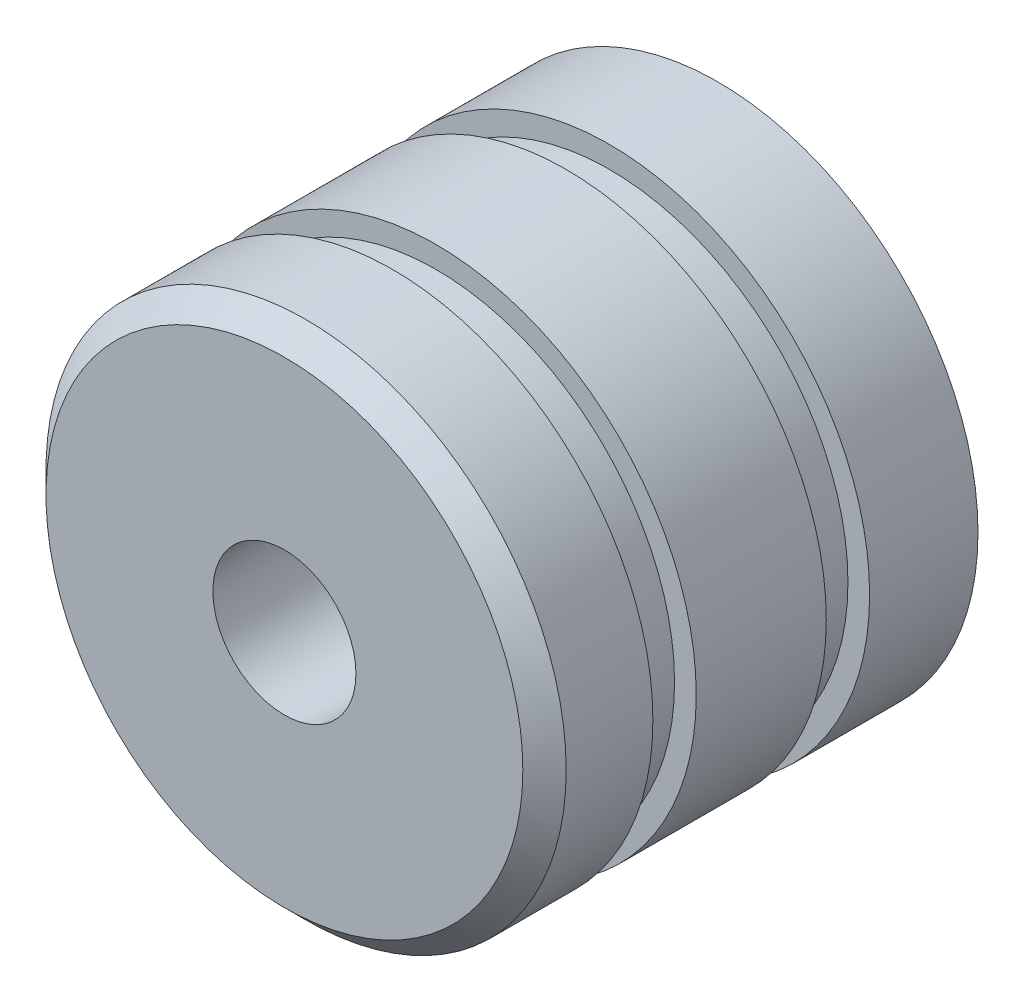
ISO-10303-21;
HEADER;
FILE_DESCRIPTION(('STEP AP214'),'2;1');
FILE_NAME('part.step','',(''),(''),'','','');
FILE_SCHEMA(('AUTOMOTIVE_DESIGN { 1 0 10303 214 1 1 1 1 }'));
ENDSEC;
DATA;
#1=APPLICATION_CONTEXT('core data for automotive mechanical design processes');
#2=APPLICATION_PROTOCOL_DEFINITION('international standard','automotive_design',2000,#1);
#3=PRODUCT_CONTEXT('',#1,'mechanical');
#4=PRODUCT('Part','Part','',(#3));
#5=PRODUCT_RELATED_PRODUCT_CATEGORY('part','',(#4));
#6=PRODUCT_DEFINITION_FORMATION('','',#4);
#7=PRODUCT_DEFINITION_CONTEXT('part definition',#1,'design');
#8=PRODUCT_DEFINITION('design','',#6,#7);
#9=PRODUCT_DEFINITION_SHAPE('','',#8);
#10=(LENGTH_UNIT() NAMED_UNIT(*) SI_UNIT(.MILLI.,.METRE.));
#11=(NAMED_UNIT(*) PLANE_ANGLE_UNIT() SI_UNIT($,.RADIAN.));
#12=(NAMED_UNIT(*) SI_UNIT($,.STERADIAN.) SOLID_ANGLE_UNIT());
#13=UNCERTAINTY_MEASURE_WITH_UNIT(LENGTH_MEASURE(1.E-05),#10,'distance_accuracy_value','');
#14=(GEOMETRIC_REPRESENTATION_CONTEXT(3) GLOBAL_UNCERTAINTY_ASSIGNED_CONTEXT((#13)) GLOBAL_UNIT_ASSIGNED_CONTEXT((#10,
#11,#12)) REPRESENTATION_CONTEXT('',''));
#15=CARTESIAN_POINT('',(0.,0.,0.));
#16=DIRECTION('',(0.,0.,1.));
#17=DIRECTION('',(1.,0.,0.));
#18=AXIS2_PLACEMENT_3D('',#15,#16,#17);
#19=CARTESIAN_POINT('',(0.,0.,5.));
#20=DIRECTION('',(0.,0.,-1.));
#21=DIRECTION('',(-1.,0.,0.));
#22=AXIS2_PLACEMENT_3D('',#19,#20,#21);
#23=CYLINDRICAL_SURFACE('',#22,6.);
#24=CARTESIAN_POINT('',(0.,0.,1.5));
#25=DIRECTION('',(0.,0.,1.));
#26=DIRECTION('',(1.,0.,0.));
#27=AXIS2_PLACEMENT_3D('',#24,#25,#26);
#28=CIRCLE('',#27,6.);
#29=CARTESIAN_POINT('',(6.,0.,1.5));
#30=VERTEX_POINT('',#29);
#31=EDGE_CURVE('E93',#30,#30,#28,.T.);
#32=ORIENTED_EDGE('',*,*,#31,.F.);
#33=EDGE_LOOP('',(#32));
#34=FACE_BOUND('',#33,.T.);
#35=CARTESIAN_POINT('',(0.,0.,-1.5));
#36=DIRECTION('',(0.,0.,1.));
#37=DIRECTION('',(1.,0.,0.));
#38=AXIS2_PLACEMENT_3D('',#35,#36,#37);
#39=CIRCLE('',#38,6.);
#40=CARTESIAN_POINT('',(6.,0.,-1.5));
#41=VERTEX_POINT('',#40);
#42=EDGE_CURVE('E81',#41,#41,#39,.T.);
#43=ORIENTED_EDGE('',*,*,#42,.T.);
#44=EDGE_LOOP('',(#43));
#45=FACE_BOUND('',#44,.T.);
#46=ADVANCED_FACE('F49',(#34,#45),#23,.T.);
#47=CARTESIAN_POINT('',(0.,0.,1.5));
#48=DIRECTION('',(0.,0.,1.));
#49=DIRECTION('',(1.,0.,0.));
#50=AXIS2_PLACEMENT_3D('',#47,#48,#49);
#51=PLANE('',#50);
#52=CARTESIAN_POINT('',(0.,0.,1.5));
#53=DIRECTION('',(0.,0.,1.));
#54=DIRECTION('',(1.,0.,0.));
#55=AXIS2_PLACEMENT_3D('',#52,#53,#54);
#56=CIRCLE('',#55,5.5);
#57=CARTESIAN_POINT('',(5.5,0.,1.5));
#58=VERTEX_POINT('',#57);
#59=EDGE_CURVE('E87',#58,#58,#56,.T.);
#60=ORIENTED_EDGE('',*,*,#59,.F.);
#61=EDGE_LOOP('',(#60));
#62=FACE_BOUND('',#61,.T.);
#63=ORIENTED_EDGE('',*,*,#31,.T.);
#64=EDGE_LOOP('',(#63));
#65=FACE_BOUND('',#64,.T.);
#66=ADVANCED_FACE('F118',(#62,#65),#51,.T.);
#67=CARTESIAN_POINT('',(0.,0.,2.5));
#68=DIRECTION('',(0.,0.,1.));
#69=DIRECTION('',(1.,0.,0.));
#70=AXIS2_PLACEMENT_3D('',#67,#68,#69);
#71=PLANE('',#70);
#72=CARTESIAN_POINT('',(0.,0.,2.5));
#73=DIRECTION('',(0.,0.,1.));
#74=DIRECTION('',(1.,0.,0.));
#75=AXIS2_PLACEMENT_3D('',#72,#73,#74);
#76=CIRCLE('',#75,5.5);
#77=CARTESIAN_POINT('',(5.5,0.,2.5));
#78=VERTEX_POINT('',#77);
#79=EDGE_CURVE('E84',#78,#78,#76,.T.);
#80=ORIENTED_EDGE('',*,*,#79,.T.);
#81=EDGE_LOOP('',(#80));
#82=FACE_BOUND('',#81,.T.);
#83=CARTESIAN_POINT('',(0.,0.,2.5));
#84=DIRECTION('',(0.,0.,1.));
#85=DIRECTION('',(1.,0.,0.));
#86=AXIS2_PLACEMENT_3D('',#83,#84,#85);
#87=CIRCLE('',#86,6.);
#88=CARTESIAN_POINT('',(6.,0.,2.5));
#89=VERTEX_POINT('',#88);
#90=EDGE_CURVE('E90',#89,#89,#87,.T.);
#91=ORIENTED_EDGE('',*,*,#90,.F.);
#92=EDGE_LOOP('',(#91));
#93=FACE_BOUND('',#92,.T.);
#94=ADVANCED_FACE('F125',(#82,#93),#71,.F.);
#95=CARTESIAN_POINT('',(0.,0.,1.5));
#96=DIRECTION('',(0.,0.,1.));
#97=DIRECTION('',(1.,0.,0.));
#98=AXIS2_PLACEMENT_3D('',#95,#96,#97);
#99=CYLINDRICAL_SURFACE('',#98,5.5);
#100=ORIENTED_EDGE('',*,*,#59,.T.);
#101=EDGE_LOOP('',(#100));
#102=FACE_BOUND('',#101,.T.);
#103=ORIENTED_EDGE('',*,*,#79,.F.);
#104=EDGE_LOOP('',(#103));
#105=FACE_BOUND('',#104,.T.);
#106=ADVANCED_FACE('F139',(#102,#105),#99,.T.);
#107=CARTESIAN_POINT('',(0.,0.,5.));
#108=DIRECTION('',(0.,0.,1.));
#109=DIRECTION('',(1.,0.,0.));
#110=AXIS2_PLACEMENT_3D('',#107,#108,#109);
#111=PLANE('',#110);
#112=CARTESIAN_POINT('',(0.,0.,5.));
#113=DIRECTION('',(0.,0.,1.));
#114=DIRECTION('',(1.,0.,0.));
#115=AXIS2_PLACEMENT_3D('',#112,#113,#114);
#116=CIRCLE('',#115,1.64999999999999);
#117=CARTESIAN_POINT('',(1.64999999999999,0.,5.));
#118=VERTEX_POINT('',#117);
#119=EDGE_CURVE('E70',#118,#118,#116,.T.);
#120=ORIENTED_EDGE('',*,*,#119,.F.);
#121=EDGE_LOOP('',(#120));
#122=FACE_BOUND('',#121,.T.);
#123=CARTESIAN_POINT('',(0.,0.,5.));
#124=DIRECTION('',(0.,0.,1.));
#125=DIRECTION('',(1.,0.,0.));
#126=AXIS2_PLACEMENT_3D('',#123,#124,#125);
#127=CIRCLE('',#126,5.50000000000001);
#128=CARTESIAN_POINT('',(5.50000000000001,0.,5.));
#129=VERTEX_POINT('',#128);
#130=EDGE_CURVE('E57',#129,#129,#127,.T.);
#131=ORIENTED_EDGE('',*,*,#130,.T.);
#132=EDGE_LOOP('',(#131));
#133=FACE_BOUND('',#132,.T.);
#134=ADVANCED_FACE('F103',(#122,#133),#111,.T.);
#135=CARTESIAN_POINT('',(0.,0.,4.5));
#136=DIRECTION('',(0.,0.,1.));
#137=DIRECTION('',(1.,0.,0.));
#138=AXIS2_PLACEMENT_3D('',#135,#136,#137);
#139=CIRCLE('',#138,6.);
#140=CARTESIAN_POINT('',(6.,0.,4.5));
#141=VERTEX_POINT('',#140);
#142=EDGE_CURVE('E11',#141,#141,#139,.F.);
#143=ORIENTED_EDGE('',*,*,#142,.T.);
#144=EDGE_LOOP('',(#143));
#145=FACE_BOUND('',#144,.T.);
#146=ORIENTED_EDGE('',*,*,#90,.T.);
#147=EDGE_LOOP('',(#146));
#148=FACE_BOUND('',#147,.T.);
#149=ADVANCED_FACE('F115',(#145,#148),#23,.T.);
#150=CARTESIAN_POINT('',(0.,0.,-1.5));
#151=DIRECTION('',(0.,0.,-1.));
#152=DIRECTION('',(1.,0.,0.));
#153=AXIS2_PLACEMENT_3D('',#150,#151,#152);
#154=PLANE('',#153);
#155=ORIENTED_EDGE('',*,*,#42,.F.);
#156=EDGE_LOOP('',(#155));
#157=FACE_BOUND('',#156,.T.);
#158=CARTESIAN_POINT('',(0.,0.,-1.5));
#159=DIRECTION('',(0.,0.,1.));
#160=DIRECTION('',(1.,0.,0.));
#161=AXIS2_PLACEMENT_3D('',#158,#159,#160);
#162=CIRCLE('',#161,5.5);
#163=CARTESIAN_POINT('',(5.5,0.,-1.5));
#164=VERTEX_POINT('',#163);
#165=EDGE_CURVE('E73',#164,#164,#162,.T.);
#166=ORIENTED_EDGE('',*,*,#165,.T.);
#167=EDGE_LOOP('',(#166));
#168=FACE_BOUND('',#167,.T.);
#169=ADVANCED_FACE('F131',(#157,#168),#154,.T.);
#170=CARTESIAN_POINT('',(0.,0.,-2.5));
#171=DIRECTION('',(0.,0.,-1.));
#172=DIRECTION('',(1.,0.,0.));
#173=AXIS2_PLACEMENT_3D('',#170,#171,#172);
#174=PLANE('',#173);
#175=CARTESIAN_POINT('',(0.,0.,-2.5));
#176=DIRECTION('',(0.,0.,1.));
#177=DIRECTION('',(1.,0.,0.));
#178=AXIS2_PLACEMENT_3D('',#175,#176,#177);
#179=CIRCLE('',#178,6.);
#180=CARTESIAN_POINT('',(6.,0.,-2.5));
#181=VERTEX_POINT('',#180);
#182=EDGE_CURVE('E79',#181,#181,#179,.T.);
#183=ORIENTED_EDGE('',*,*,#182,.T.);
#184=EDGE_LOOP('',(#183));
#185=FACE_BOUND('',#184,.T.);
#186=CARTESIAN_POINT('',(0.,0.,-2.5));
#187=DIRECTION('',(0.,0.,1.));
#188=DIRECTION('',(1.,0.,0.));
#189=AXIS2_PLACEMENT_3D('',#186,#187,#188);
#190=CIRCLE('',#189,5.5);
#191=CARTESIAN_POINT('',(5.5,0.,-2.5));
#192=VERTEX_POINT('',#191);
#193=EDGE_CURVE('E69',#192,#192,#190,.T.);
#194=ORIENTED_EDGE('',*,*,#193,.F.);
#195=EDGE_LOOP('',(#194));
#196=FACE_BOUND('',#195,.T.);
#197=ADVANCED_FACE('F135',(#185,#196),#174,.F.);
#198=CARTESIAN_POINT('',(0.,0.,-1.5));
#199=DIRECTION('',(0.,0.,-1.));
#200=DIRECTION('',(-1.,0.,0.));
#201=AXIS2_PLACEMENT_3D('',#198,#199,#200);
#202=CYLINDRICAL_SURFACE('',#201,5.5);
#203=ORIENTED_EDGE('',*,*,#165,.F.);
#204=EDGE_LOOP('',(#203));
#205=FACE_BOUND('',#204,.T.);
#206=ORIENTED_EDGE('',*,*,#193,.T.);
#207=EDGE_LOOP('',(#206));
#208=FACE_BOUND('',#207,.T.);
#209=ADVANCED_FACE('F153',(#205,#208),#202,.T.);
#210=CARTESIAN_POINT('',(0.,0.,-5.));
#211=DIRECTION('',(0.,0.,1.));
#212=DIRECTION('',(1.,0.,0.));
#213=AXIS2_PLACEMENT_3D('',#210,#211,#212);
#214=PLANE('',#213);
#215=CARTESIAN_POINT('',(0.,0.,-5.));
#216=DIRECTION('',(0.,0.,1.));
#217=DIRECTION('',(1.,0.,0.));
#218=AXIS2_PLACEMENT_3D('',#215,#216,#217);
#219=CIRCLE('',#218,6.);
#220=CARTESIAN_POINT('',(6.,0.,-5.));
#221=VERTEX_POINT('',#220);
#222=EDGE_CURVE('E96',#221,#221,#219,.T.);
#223=ORIENTED_EDGE('',*,*,#222,.F.);
#224=EDGE_LOOP('',(#223));
#225=FACE_BOUND('',#224,.T.);
#226=ADVANCED_FACE('F113',(#225),#214,.F.);
#227=ORIENTED_EDGE('',*,*,#182,.F.);
#228=EDGE_LOOP('',(#227));
#229=FACE_BOUND('',#228,.T.);
#230=ORIENTED_EDGE('',*,*,#222,.T.);
#231=EDGE_LOOP('',(#230));
#232=FACE_BOUND('',#231,.T.);
#233=ADVANCED_FACE('F106',(#229,#232),#23,.T.);
#234=CARTESIAN_POINT('',(0.,0.,5.));
#235=DIRECTION('',(0.,0.,-1.));
#236=DIRECTION('',(-1.,0.,0.));
#237=AXIS2_PLACEMENT_3D('',#234,#235,#236);
#238=CONICAL_SURFACE('',#237,5.50000000000001,0.785398163397444);
#239=ORIENTED_EDGE('',*,*,#142,.F.);
#240=EDGE_LOOP('',(#239));
#241=FACE_BOUND('',#240,.T.);
#242=ORIENTED_EDGE('',*,*,#130,.F.);
#243=EDGE_LOOP('',(#242));
#244=FACE_BOUND('',#243,.T.);
#245=ADVANCED_FACE('F52',(#241,#244),#238,.T.);
#246=CARTESIAN_POINT('',(0.,0.,-3.));
#247=DIRECTION('',(0.,0.,1.));
#248=DIRECTION('',(1.,0.,0.));
#249=AXIS2_PLACEMENT_3D('',#246,#247,#248);
#250=CONICAL_SURFACE('',#249,1.65,1.02974425867665);
#251=CARTESIAN_POINT('',(0.,0.,-3.99142002139547));
#252=VERTEX_POINT('',#251);
#253=VERTEX_LOOP('',#252);
#254=FACE_BOUND('',#253,.T.);
#255=CARTESIAN_POINT('',(0.,0.,-3.));
#256=DIRECTION('',(0.,0.,1.));
#257=DIRECTION('',(1.,0.,0.));
#258=AXIS2_PLACEMENT_3D('',#255,#256,#257);
#259=CIRCLE('',#258,1.65);
#260=CARTESIAN_POINT('',(1.65,0.,-3.));
#261=VERTEX_POINT('',#260);
#262=EDGE_CURVE('E67',#261,#261,#259,.T.);
#263=ORIENTED_EDGE('',*,*,#262,.T.);
#264=EDGE_LOOP('',(#263));
#265=FACE_BOUND('',#264,.T.);
#266=ADVANCED_FACE('F60',(#254,#265),#250,.F.);
#267=CARTESIAN_POINT('',(0.,0.,5.));
#268=DIRECTION('',(0.,0.,1.));
#269=DIRECTION('',(1.,0.,0.));
#270=AXIS2_PLACEMENT_3D('',#267,#268,#269);
#271=CYLINDRICAL_SURFACE('',#270,1.64999999999999);
#272=ORIENTED_EDGE('',*,*,#262,.F.);
#273=EDGE_LOOP('',(#272));
#274=FACE_BOUND('',#273,.T.);
#275=ORIENTED_EDGE('',*,*,#119,.T.);
#276=EDGE_LOOP('',(#275));
#277=FACE_BOUND('',#276,.T.);
#278=ADVANCED_FACE('F63',(#274,#277),#271,.F.);
#279=CLOSED_SHELL('',(#46,#66,#94,#106,#134,#149,#169,#197,#209,#226,#233,#245,#266,#278));
#280=MANIFOLD_SOLID_BREP('B2',#279);
#281=ADVANCED_BREP_SHAPE_REPRESENTATION('',(#18,#280),#14);
#282=SHAPE_DEFINITION_REPRESENTATION(#9,#281);
ENDSEC;
END-ISO-10303-21;
